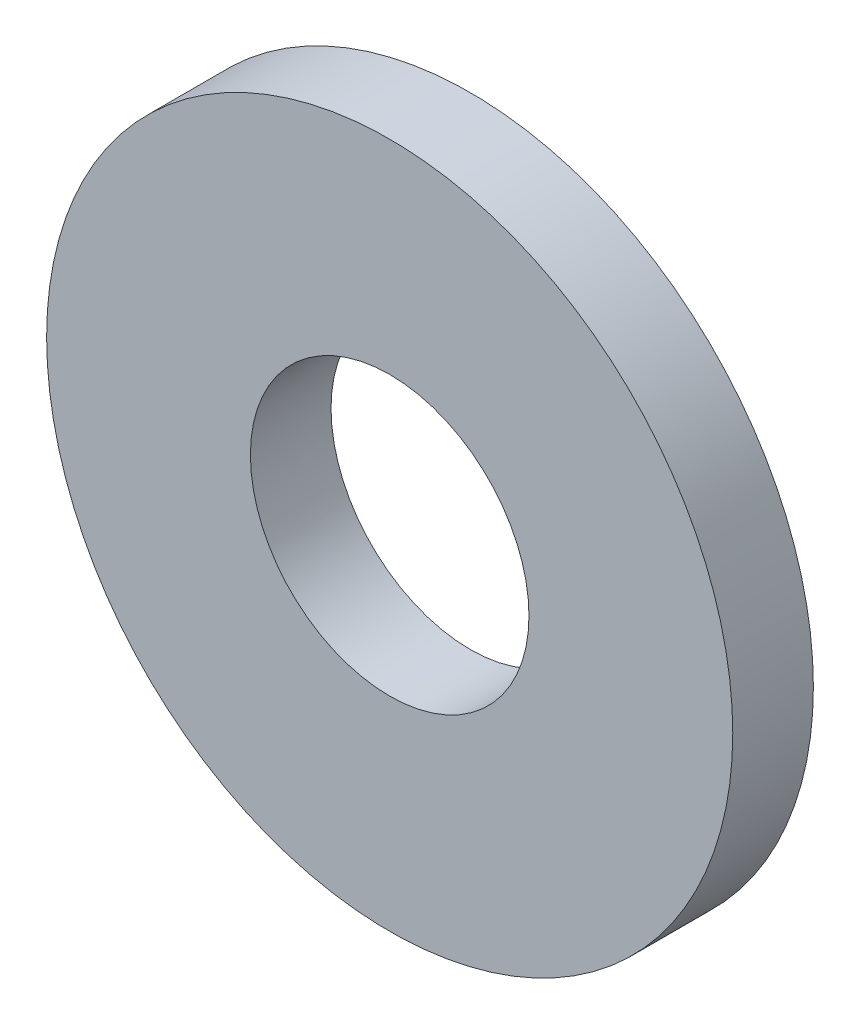
ISO-10303-21;
HEADER;
FILE_DESCRIPTION(('STEP AP214'),'2;1');
FILE_NAME('part.step','',(''),(''),'','','');
FILE_SCHEMA(('AUTOMOTIVE_DESIGN { 1 0 10303 214 1 1 1 1 }'));
ENDSEC;
DATA;
#1=APPLICATION_CONTEXT('core data for automotive mechanical design processes');
#2=APPLICATION_PROTOCOL_DEFINITION('international standard','automotive_design',2000,#1);
#3=PRODUCT_CONTEXT('',#1,'mechanical');
#4=PRODUCT('Part','Part','',(#3));
#5=PRODUCT_RELATED_PRODUCT_CATEGORY('part','',(#4));
#6=PRODUCT_DEFINITION_FORMATION('','',#4);
#7=PRODUCT_DEFINITION_CONTEXT('part definition',#1,'design');
#8=PRODUCT_DEFINITION('design','',#6,#7);
#9=PRODUCT_DEFINITION_SHAPE('','',#8);
#10=(LENGTH_UNIT() NAMED_UNIT(*) SI_UNIT(.MILLI.,.METRE.));
#11=(NAMED_UNIT(*) PLANE_ANGLE_UNIT() SI_UNIT($,.RADIAN.));
#12=(NAMED_UNIT(*) SI_UNIT($,.STERADIAN.) SOLID_ANGLE_UNIT());
#13=UNCERTAINTY_MEASURE_WITH_UNIT(LENGTH_MEASURE(1.E-05),#10,'distance_accuracy_value','');
#14=(GEOMETRIC_REPRESENTATION_CONTEXT(3) GLOBAL_UNCERTAINTY_ASSIGNED_CONTEXT((#13)) GLOBAL_UNIT_ASSIGNED_CONTEXT((#10,
#11,#12)) REPRESENTATION_CONTEXT('',''));
#15=CARTESIAN_POINT('',(0.,0.,0.));
#16=DIRECTION('',(0.,0.,1.));
#17=DIRECTION('',(1.,0.,0.));
#18=AXIS2_PLACEMENT_3D('',#15,#16,#17);
#19=CARTESIAN_POINT('',(0.,0.,1.49225));
#20=DIRECTION('',(0.,0.,1.));
#21=DIRECTION('',(1.,0.,0.));
#22=AXIS2_PLACEMENT_3D('',#19,#20,#21);
#23=PLANE('',#22);
#24=CARTESIAN_POINT('',(0.,0.,1.49225));
#25=DIRECTION('',(0.,0.,1.));
#26=DIRECTION('',(1.,0.,0.));
#27=AXIS2_PLACEMENT_3D('',#24,#25,#26);
#28=CIRCLE('',#27,12.7);
#29=CARTESIAN_POINT('',(12.7,0.,1.49225));
#30=VERTEX_POINT('',#29);
#31=EDGE_CURVE('E10',#30,#30,#28,.T.);
#32=ORIENTED_EDGE('',*,*,#31,.T.);
#33=EDGE_LOOP('',(#32));
#34=FACE_BOUND('',#33,.T.);
#35=CARTESIAN_POINT('',(0.,0.,1.49225));
#36=DIRECTION('',(0.,0.,1.));
#37=DIRECTION('',(1.,0.,0.));
#38=AXIS2_PLACEMENT_3D('',#35,#36,#37);
#39=CIRCLE('',#38,5.1562);
#40=CARTESIAN_POINT('',(5.1562,0.,1.49225));
#41=VERTEX_POINT('',#40);
#42=EDGE_CURVE('E43',#41,#41,#39,.T.);
#43=ORIENTED_EDGE('',*,*,#42,.F.);
#44=EDGE_LOOP('',(#43));
#45=FACE_BOUND('',#44,.T.);
#46=ADVANCED_FACE('F32',(#34,#45),#23,.T.);
#47=CARTESIAN_POINT('',(0.,0.,-1.49225));
#48=DIRECTION('',(0.,0.,1.));
#49=DIRECTION('',(1.,0.,0.));
#50=AXIS2_PLACEMENT_3D('',#47,#48,#49);
#51=PLANE('',#50);
#52=CARTESIAN_POINT('',(0.,0.,-1.49225));
#53=DIRECTION('',(0.,0.,1.));
#54=DIRECTION('',(1.,0.,0.));
#55=AXIS2_PLACEMENT_3D('',#52,#53,#54);
#56=CIRCLE('',#55,12.7);
#57=CARTESIAN_POINT('',(12.7,0.,-1.49225));
#58=VERTEX_POINT('',#57);
#59=EDGE_CURVE('E36',#58,#58,#56,.T.);
#60=ORIENTED_EDGE('',*,*,#59,.F.);
#61=EDGE_LOOP('',(#60));
#62=FACE_BOUND('',#61,.T.);
#63=CARTESIAN_POINT('',(0.,0.,-1.49225));
#64=DIRECTION('',(0.,0.,1.));
#65=DIRECTION('',(1.,0.,0.));
#66=AXIS2_PLACEMENT_3D('',#63,#64,#65);
#67=CIRCLE('',#66,5.1562);
#68=CARTESIAN_POINT('',(5.1562,0.,-1.49225));
#69=VERTEX_POINT('',#68);
#70=EDGE_CURVE('E45',#69,#69,#67,.T.);
#71=ORIENTED_EDGE('',*,*,#70,.T.);
#72=EDGE_LOOP('',(#71));
#73=FACE_BOUND('',#72,.T.);
#74=ADVANCED_FACE('F55',(#62,#73),#51,.F.);
#75=CARTESIAN_POINT('',(0.,0.,1.49225));
#76=DIRECTION('',(0.,0.,-1.));
#77=DIRECTION('',(-1.,0.,0.));
#78=AXIS2_PLACEMENT_3D('',#75,#76,#77);
#79=CYLINDRICAL_SURFACE('',#78,12.7);
#80=ORIENTED_EDGE('',*,*,#31,.F.);
#81=EDGE_LOOP('',(#80));
#82=FACE_BOUND('',#81,.T.);
#83=ORIENTED_EDGE('',*,*,#59,.T.);
#84=EDGE_LOOP('',(#83));
#85=FACE_BOUND('',#84,.T.);
#86=ADVANCED_FACE('F34',(#82,#85),#79,.T.);
#87=CARTESIAN_POINT('',(0.,0.,1.49225));
#88=DIRECTION('',(0.,0.,-1.));
#89=DIRECTION('',(-1.,0.,0.));
#90=AXIS2_PLACEMENT_3D('',#87,#88,#89);
#91=CYLINDRICAL_SURFACE('',#90,5.1562);
#92=ORIENTED_EDGE('',*,*,#42,.T.);
#93=EDGE_LOOP('',(#92));
#94=FACE_BOUND('',#93,.T.);
#95=ORIENTED_EDGE('',*,*,#70,.F.);
#96=EDGE_LOOP('',(#95));
#97=FACE_BOUND('',#96,.T.);
#98=ADVANCED_FACE('F51',(#94,#97),#91,.F.);
#99=CLOSED_SHELL('',(#46,#74,#86,#98));
#100=MANIFOLD_SOLID_BREP('B2',#99);
#101=ADVANCED_BREP_SHAPE_REPRESENTATION('',(#18,#100),#14);
#102=SHAPE_DEFINITION_REPRESENTATION(#9,#101);
ENDSEC;
END-ISO-10303-21;
